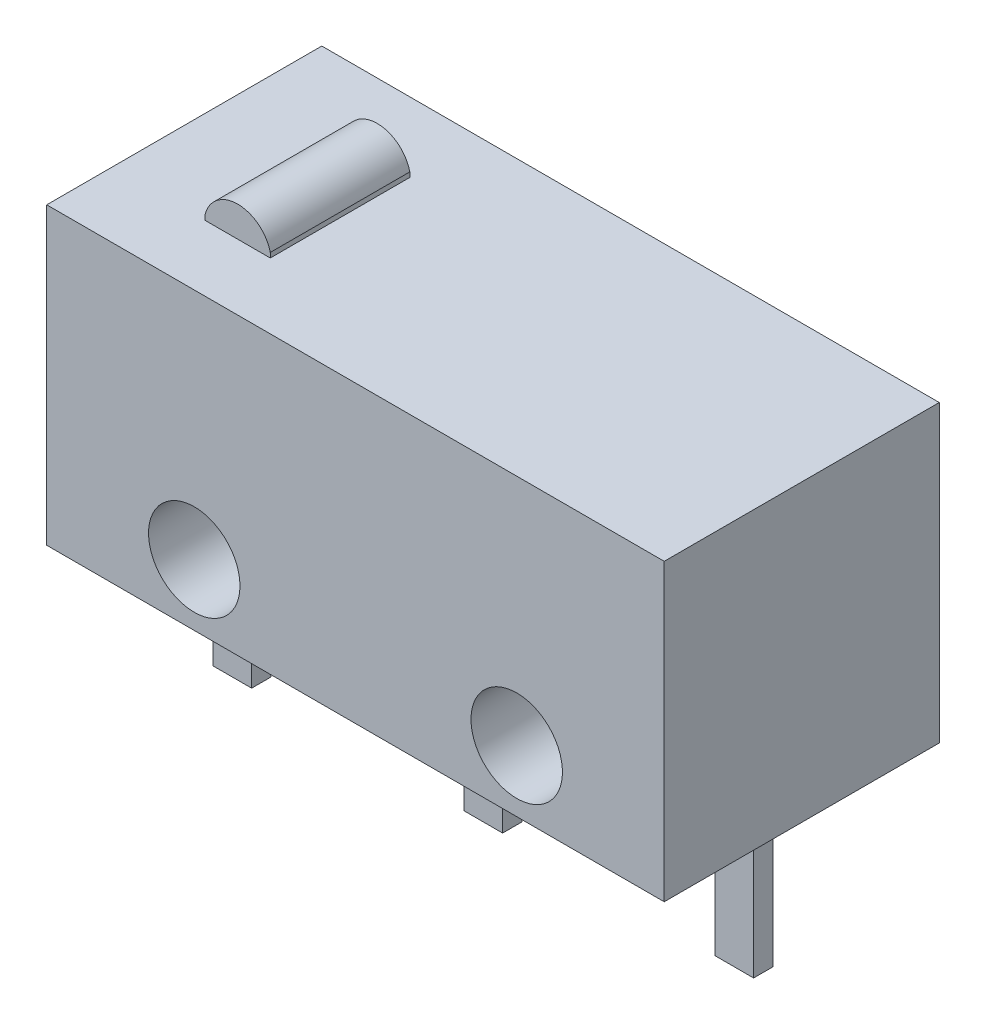
ISO-10303-21;
HEADER;
FILE_DESCRIPTION(('STEP AP214'),'2;1');
FILE_NAME('part.step','',(''),(''),'','','');
FILE_SCHEMA(('AUTOMOTIVE_DESIGN { 1 0 10303 214 1 1 1 1 }'));
ENDSEC;
DATA;
#1=APPLICATION_CONTEXT('core data for automotive mechanical design processes');
#2=APPLICATION_PROTOCOL_DEFINITION('international standard','automotive_design',2000,#1);
#3=PRODUCT_CONTEXT('',#1,'mechanical');
#4=PRODUCT('Part','Part','',(#3));
#5=PRODUCT_RELATED_PRODUCT_CATEGORY('part','',(#4));
#6=PRODUCT_DEFINITION_FORMATION('','',#4);
#7=PRODUCT_DEFINITION_CONTEXT('part definition',#1,'design');
#8=PRODUCT_DEFINITION('design','',#6,#7);
#9=PRODUCT_DEFINITION_SHAPE('','',#8);
#10=(LENGTH_UNIT() NAMED_UNIT(*) SI_UNIT(.MILLI.,.METRE.));
#11=(NAMED_UNIT(*) PLANE_ANGLE_UNIT() SI_UNIT($,.RADIAN.));
#12=(NAMED_UNIT(*) SI_UNIT($,.STERADIAN.) SOLID_ANGLE_UNIT());
#13=UNCERTAINTY_MEASURE_WITH_UNIT(LENGTH_MEASURE(1.E-05),#10,'distance_accuracy_value','');
#14=(GEOMETRIC_REPRESENTATION_CONTEXT(3) GLOBAL_UNCERTAINTY_ASSIGNED_CONTEXT((#13)) GLOBAL_UNIT_ASSIGNED_CONTEXT((#10,
#11,#12)) REPRESENTATION_CONTEXT('',''));
#15=CARTESIAN_POINT('',(0.,0.,0.));
#16=DIRECTION('',(0.,0.,1.));
#17=DIRECTION('',(1.,0.,0.));
#18=AXIS2_PLACEMENT_3D('',#15,#16,#17);
#19=CARTESIAN_POINT('',(-9.68,-1.5,2.815));
#20=DIRECTION('',(0.,-1.,0.));
#21=DIRECTION('',(0.,0.,-1.));
#22=AXIS2_PLACEMENT_3D('',#19,#20,#21);
#23=PLANE('',#22);
#24=DIRECTION('',(0.,0.,-1.));
#25=VECTOR('',#24,1.);
#26=CARTESIAN_POINT('',(-3.665,-1.5,-0.2425));
#27=LINE('',#26,#25);
#28=CARTESIAN_POINT('',(-3.665,-1.5,0.157500000000001));
#29=VERTEX_POINT('',#28);
#30=CARTESIAN_POINT('',(-3.665,-1.5,-0.2425));
#31=VERTEX_POINT('',#30);
#32=EDGE_CURVE('E253',#29,#31,#27,.T.);
#33=ORIENTED_EDGE('',*,*,#32,.F.);
#34=DIRECTION('',(-1.,0.,0.));
#35=VECTOR('',#34,1.);
#36=CARTESIAN_POINT('',(-3.665,-1.5,0.157500000000001));
#37=LINE('',#36,#35);
#38=CARTESIAN_POINT('',(-2.865,-1.5,0.157500000000001));
#39=VERTEX_POINT('',#38);
#40=EDGE_CURVE('E239',#39,#29,#37,.T.);
#41=ORIENTED_EDGE('',*,*,#40,.F.);
#42=DIRECTION('',(0.,0.,1.));
#43=VECTOR('',#42,1.);
#44=CARTESIAN_POINT('',(-2.865,-1.5,0.157500000000001));
#45=LINE('',#44,#43);
#46=CARTESIAN_POINT('',(-2.865,-1.5,-0.2425));
#47=VERTEX_POINT('',#46);
#48=EDGE_CURVE('E244',#47,#39,#45,.T.);
#49=ORIENTED_EDGE('',*,*,#48,.F.);
#50=DIRECTION('',(1.,0.,0.));
#51=VECTOR('',#50,1.);
#52=CARTESIAN_POINT('',(-2.865,-1.5,-0.2425));
#53=LINE('',#52,#51);
#54=EDGE_CURVE('E255',#31,#47,#53,.T.);
#55=ORIENTED_EDGE('',*,*,#54,.F.);
#56=EDGE_LOOP('',(#33,#41,#49,#55));
#57=FACE_BOUND('',#56,.T.);
#58=DIRECTION('',(0.,0.,-1.));
#59=VECTOR('',#58,1.);
#60=CARTESIAN_POINT('',(3.15,-1.5,2.815));
#61=LINE('',#60,#59);
#62=CARTESIAN_POINT('',(3.15,-1.5,2.815));
#63=VERTEX_POINT('',#62);
#64=CARTESIAN_POINT('',(3.15,-1.5,-2.9));
#65=VERTEX_POINT('',#64);
#66=EDGE_CURVE('E318',#63,#65,#61,.T.);
#67=ORIENTED_EDGE('',*,*,#66,.F.);
#68=DIRECTION('',(1.,0.,0.));
#69=VECTOR('',#68,1.);
#70=CARTESIAN_POINT('',(-9.68,-1.5,2.815));
#71=LINE('',#70,#69);
#72=CARTESIAN_POINT('',(-9.68,-1.5,2.815));
#73=VERTEX_POINT('',#72);
#74=EDGE_CURVE('E11',#73,#63,#71,.T.);
#75=ORIENTED_EDGE('',*,*,#74,.F.);
#76=DIRECTION('',(0.,0.,-1.));
#77=VECTOR('',#76,1.);
#78=CARTESIAN_POINT('',(-9.68,-1.5,2.815));
#79=LINE('',#78,#77);
#80=CARTESIAN_POINT('',(-9.68,-1.5,-2.9));
#81=VERTEX_POINT('',#80);
#82=EDGE_CURVE('E304',#73,#81,#79,.T.);
#83=ORIENTED_EDGE('',*,*,#82,.T.);
#84=DIRECTION('',(1.,0.,0.));
#85=VECTOR('',#84,1.);
#86=CARTESIAN_POINT('',(-9.68,-1.5,-2.9));
#87=LINE('',#86,#85);
#88=EDGE_CURVE('E317',#81,#65,#87,.T.);
#89=ORIENTED_EDGE('',*,*,#88,.T.);
#90=EDGE_LOOP('',(#67,#75,#83,#89));
#91=FACE_BOUND('',#90,.T.);
#92=DIRECTION('',(0.,0.,-1.));
#93=VECTOR('',#92,1.);
#94=CARTESIAN_POINT('',(-8.88,-1.5,-0.2425));
#95=LINE('',#94,#93);
#96=CARTESIAN_POINT('',(-8.88,-1.5,0.1575));
#97=VERTEX_POINT('',#96);
#98=CARTESIAN_POINT('',(-8.88,-1.5,-0.2425));
#99=VERTEX_POINT('',#98);
#100=EDGE_CURVE('E282',#97,#99,#95,.T.);
#101=ORIENTED_EDGE('',*,*,#100,.F.);
#102=DIRECTION('',(-1.,0.,0.));
#103=VECTOR('',#102,1.);
#104=CARTESIAN_POINT('',(-8.88,-1.5,0.1575));
#105=LINE('',#104,#103);
#106=CARTESIAN_POINT('',(-8.08,-1.5,0.1575));
#107=VERTEX_POINT('',#106);
#108=EDGE_CURVE('E268',#107,#97,#105,.T.);
#109=ORIENTED_EDGE('',*,*,#108,.F.);
#110=DIRECTION('',(0.,0.,1.));
#111=VECTOR('',#110,1.);
#112=CARTESIAN_POINT('',(-8.08,-1.5,0.1575));
#113=LINE('',#112,#111);
#114=CARTESIAN_POINT('',(-8.08,-1.5,-0.2425));
#115=VERTEX_POINT('',#114);
#116=EDGE_CURVE('E273',#115,#107,#113,.T.);
#117=ORIENTED_EDGE('',*,*,#116,.F.);
#118=DIRECTION('',(1.,0.,0.));
#119=VECTOR('',#118,1.);
#120=CARTESIAN_POINT('',(-8.08,-1.5,-0.2425));
#121=LINE('',#120,#119);
#122=EDGE_CURVE('E284',#99,#115,#121,.T.);
#123=ORIENTED_EDGE('',*,*,#122,.F.);
#124=EDGE_LOOP('',(#101,#109,#117,#123));
#125=FACE_BOUND('',#124,.T.);
#126=DIRECTION('',(-1.,0.,0.));
#127=VECTOR('',#126,1.);
#128=CARTESIAN_POINT('',(2.35,-1.5,0.1575));
#129=LINE('',#128,#127);
#130=CARTESIAN_POINT('',(2.35,-1.5,0.1575));
#131=VERTEX_POINT('',#130);
#132=CARTESIAN_POINT('',(1.55,-1.5,0.1575));
#133=VERTEX_POINT('',#132);
#134=EDGE_CURVE('E226',#131,#133,#129,.T.);
#135=ORIENTED_EDGE('',*,*,#134,.F.);
#136=DIRECTION('',(0.,0.,1.));
#137=VECTOR('',#136,1.);
#138=CARTESIAN_POINT('',(2.35,-1.5,-0.2425));
#139=LINE('',#138,#137);
#140=CARTESIAN_POINT('',(2.35,-1.5,-0.2425));
#141=VERTEX_POINT('',#140);
#142=EDGE_CURVE('E209',#141,#131,#139,.T.);
#143=ORIENTED_EDGE('',*,*,#142,.F.);
#144=DIRECTION('',(1.,0.,0.));
#145=VECTOR('',#144,1.);
#146=CARTESIAN_POINT('',(1.55,-1.5,-0.2425));
#147=LINE('',#146,#145);
#148=CARTESIAN_POINT('',(1.55,-1.5,-0.2425));
#149=VERTEX_POINT('',#148);
#150=EDGE_CURVE('E217',#149,#141,#147,.T.);
#151=ORIENTED_EDGE('',*,*,#150,.F.);
#152=DIRECTION('',(0.,0.,-1.));
#153=VECTOR('',#152,1.);
#154=CARTESIAN_POINT('',(1.55,-1.5,0.1575));
#155=LINE('',#154,#153);
#156=EDGE_CURVE('E228',#133,#149,#155,.T.);
#157=ORIENTED_EDGE('',*,*,#156,.F.);
#158=EDGE_LOOP('',(#135,#143,#151,#157));
#159=FACE_BOUND('',#158,.T.);
#160=ADVANCED_FACE('F35',(#57,#91,#125,#159),#23,.T.);
#161=CARTESIAN_POINT('',(-9.68,4.627,2.815));
#162=DIRECTION('',(0.,0.,1.));
#163=DIRECTION('',(1.,0.,0.));
#164=AXIS2_PLACEMENT_3D('',#161,#162,#163);
#165=PLANE('',#164);
#166=CARTESIAN_POINT('',(0.085,-0.222999999999999,2.815));
#167=DIRECTION('',(0.,0.,1.));
#168=DIRECTION('',(-1.,0.,0.));
#169=AXIS2_PLACEMENT_3D('',#166,#167,#168);
#170=CIRCLE('',#169,0.95);
#171=CARTESIAN_POINT('',(-0.865,-0.222999999999999,2.815));
#172=VERTEX_POINT('',#171);
#173=EDGE_CURVE('E297',#172,#172,#170,.T.);
#174=ORIENTED_EDGE('',*,*,#173,.F.);
#175=EDGE_LOOP('',(#174));
#176=FACE_BOUND('',#175,.T.);
#177=CARTESIAN_POINT('',(-6.615,-0.222999999999999,2.815));
#178=DIRECTION('',(0.,0.,1.));
#179=DIRECTION('',(1.,0.,0.));
#180=AXIS2_PLACEMENT_3D('',#177,#178,#179);
#181=CIRCLE('',#180,0.95);
#182=CARTESIAN_POINT('',(-5.665,-0.222999999999999,2.815));
#183=VERTEX_POINT('',#182);
#184=EDGE_CURVE('E300',#183,#183,#181,.T.);
#185=ORIENTED_EDGE('',*,*,#184,.F.);
#186=EDGE_LOOP('',(#185));
#187=FACE_BOUND('',#186,.T.);
#188=DIRECTION('',(0.,-1.,0.));
#189=VECTOR('',#188,1.);
#190=CARTESIAN_POINT('',(3.15,4.627,2.815));
#191=LINE('',#190,#189);
#192=CARTESIAN_POINT('',(3.15,4.627,2.815));
#193=VERTEX_POINT('',#192);
#194=EDGE_CURVE('E308',#193,#63,#191,.T.);
#195=ORIENTED_EDGE('',*,*,#194,.F.);
#196=DIRECTION('',(1.,0.,0.));
#197=VECTOR('',#196,1.);
#198=CARTESIAN_POINT('',(-9.68,4.627,2.815));
#199=LINE('',#198,#197);
#200=CARTESIAN_POINT('',(-9.68,4.627,2.815));
#201=VERTEX_POINT('',#200);
#202=EDGE_CURVE('E43',#201,#193,#199,.T.);
#203=ORIENTED_EDGE('',*,*,#202,.F.);
#204=DIRECTION('',(0.,-1.,0.));
#205=VECTOR('',#204,1.);
#206=CARTESIAN_POINT('',(-9.68,4.627,2.815));
#207=LINE('',#206,#205);
#208=EDGE_CURVE('E314',#201,#73,#207,.T.);
#209=ORIENTED_EDGE('',*,*,#208,.T.);
#210=ORIENTED_EDGE('',*,*,#74,.T.);
#211=EDGE_LOOP('',(#195,#203,#209,#210));
#212=FACE_BOUND('',#211,.T.);
#213=ADVANCED_FACE('F358',(#176,#187,#212),#165,.T.);
#214=CARTESIAN_POINT('',(-9.68,4.627,-2.9));
#215=DIRECTION('',(0.,1.,0.));
#216=DIRECTION('',(0.,0.,1.));
#217=AXIS2_PLACEMENT_3D('',#214,#215,#216);
#218=PLANE('',#217);
#219=DIRECTION('',(-1.,0.,0.));
#220=VECTOR('',#219,1.);
#221=CARTESIAN_POINT('',(-7.75567903627533,4.627,1.45));
#222=LINE('',#221,#220);
#223=CARTESIAN_POINT('',(-6.40017995171817,4.627,1.45));
#224=VERTEX_POINT('',#223);
#225=CARTESIAN_POINT('',(-7.75567903627533,4.627,1.45));
#226=VERTEX_POINT('',#225);
#227=EDGE_CURVE('E184',#224,#226,#222,.T.);
#228=ORIENTED_EDGE('',*,*,#227,.T.);
#229=DIRECTION('',(0.,0.,-1.));
#230=VECTOR('',#229,1.);
#231=CARTESIAN_POINT('',(-7.75567903627533,4.627,1.45));
#232=LINE('',#231,#230);
#233=CARTESIAN_POINT('',(-7.75567903627533,4.627,-1.45));
#234=VERTEX_POINT('',#233);
#235=EDGE_CURVE('E197',#226,#234,#232,.T.);
#236=ORIENTED_EDGE('',*,*,#235,.T.);
#237=DIRECTION('',(-1.,0.,0.));
#238=VECTOR('',#237,1.);
#239=CARTESIAN_POINT('',(-7.75567903627533,4.627,-1.45));
#240=LINE('',#239,#238);
#241=CARTESIAN_POINT('',(-6.40017995171817,4.627,-1.45));
#242=VERTEX_POINT('',#241);
#243=EDGE_CURVE('E198',#242,#234,#240,.T.);
#244=ORIENTED_EDGE('',*,*,#243,.F.);
#245=DIRECTION('',(0.,0.,-1.));
#246=VECTOR('',#245,1.);
#247=CARTESIAN_POINT('',(-6.40017995171817,4.627,1.45));
#248=LINE('',#247,#246);
#249=EDGE_CURVE('E210',#224,#242,#248,.T.);
#250=ORIENTED_EDGE('',*,*,#249,.F.);
#251=EDGE_LOOP('',(#228,#236,#244,#250));
#252=FACE_BOUND('',#251,.T.);
#253=DIRECTION('',(0.,0.,1.));
#254=VECTOR('',#253,1.);
#255=CARTESIAN_POINT('',(3.15,4.627,-2.9));
#256=LINE('',#255,#254);
#257=CARTESIAN_POINT('',(3.15,4.627,-2.9));
#258=VERTEX_POINT('',#257);
#259=EDGE_CURVE('E324',#258,#193,#256,.T.);
#260=ORIENTED_EDGE('',*,*,#259,.F.);
#261=DIRECTION('',(1.,0.,0.));
#262=VECTOR('',#261,1.);
#263=CARTESIAN_POINT('',(-9.68,4.627,-2.9));
#264=LINE('',#263,#262);
#265=CARTESIAN_POINT('',(-9.68,4.627,-2.9));
#266=VERTEX_POINT('',#265);
#267=EDGE_CURVE('E330',#266,#258,#264,.T.);
#268=ORIENTED_EDGE('',*,*,#267,.F.);
#269=DIRECTION('',(0.,0.,1.));
#270=VECTOR('',#269,1.);
#271=CARTESIAN_POINT('',(-9.68,4.627,-2.9));
#272=LINE('',#271,#270);
#273=EDGE_CURVE('E311',#266,#201,#272,.T.);
#274=ORIENTED_EDGE('',*,*,#273,.T.);
#275=ORIENTED_EDGE('',*,*,#202,.T.);
#276=EDGE_LOOP('',(#260,#268,#274,#275));
#277=FACE_BOUND('',#276,.T.);
#278=ADVANCED_FACE('F342',(#252,#277),#218,.T.);
#279=CARTESIAN_POINT('',(-9.68,-1.5,-2.9));
#280=DIRECTION('',(0.,0.,-1.));
#281=DIRECTION('',(-1.,0.,0.));
#282=AXIS2_PLACEMENT_3D('',#279,#280,#281);
#283=PLANE('',#282);
#284=CARTESIAN_POINT('',(0.085,-0.222999999999999,-2.9));
#285=DIRECTION('',(0.,0.,-1.));
#286=DIRECTION('',(-1.,0.,0.));
#287=AXIS2_PLACEMENT_3D('',#284,#285,#286);
#288=CIRCLE('',#287,0.95);
#289=CARTESIAN_POINT('',(-0.865,-0.222999999999999,-2.9));
#290=VERTEX_POINT('',#289);
#291=EDGE_CURVE('E38',#290,#290,#288,.T.);
#292=ORIENTED_EDGE('',*,*,#291,.F.);
#293=EDGE_LOOP('',(#292));
#294=FACE_BOUND('',#293,.T.);
#295=CARTESIAN_POINT('',(-6.615,-0.222999999999999,-2.9));
#296=DIRECTION('',(0.,0.,-1.));
#297=DIRECTION('',(-1.,0.,0.));
#298=AXIS2_PLACEMENT_3D('',#295,#296,#297);
#299=CIRCLE('',#298,0.95);
#300=CARTESIAN_POINT('',(-7.565,-0.222999999999999,-2.9));
#301=VERTEX_POINT('',#300);
#302=EDGE_CURVE('E303',#301,#301,#299,.T.);
#303=ORIENTED_EDGE('',*,*,#302,.F.);
#304=EDGE_LOOP('',(#303));
#305=FACE_BOUND('',#304,.T.);
#306=DIRECTION('',(0.,1.,0.));
#307=VECTOR('',#306,1.);
#308=CARTESIAN_POINT('',(3.15,-1.5,-2.9));
#309=LINE('',#308,#307);
#310=EDGE_CURVE('E321',#65,#258,#309,.T.);
#311=ORIENTED_EDGE('',*,*,#310,.F.);
#312=ORIENTED_EDGE('',*,*,#88,.F.);
#313=DIRECTION('',(0.,1.,0.));
#314=VECTOR('',#313,1.);
#315=CARTESIAN_POINT('',(-9.68,-1.5,-2.9));
#316=LINE('',#315,#314);
#317=EDGE_CURVE('E307',#81,#266,#316,.T.);
#318=ORIENTED_EDGE('',*,*,#317,.T.);
#319=ORIENTED_EDGE('',*,*,#267,.T.);
#320=EDGE_LOOP('',(#311,#312,#318,#319));
#321=FACE_BOUND('',#320,.T.);
#322=ADVANCED_FACE('F338',(#294,#305,#321),#283,.T.);
#323=CARTESIAN_POINT('',(-9.68,-1.5,-2.9));
#324=DIRECTION('',(1.,0.,0.));
#325=DIRECTION('',(0.,0.,-1.));
#326=AXIS2_PLACEMENT_3D('',#323,#324,#325);
#327=PLANE('',#326);
#328=ORIENTED_EDGE('',*,*,#82,.F.);
#329=ORIENTED_EDGE('',*,*,#208,.F.);
#330=ORIENTED_EDGE('',*,*,#273,.F.);
#331=ORIENTED_EDGE('',*,*,#317,.F.);
#332=EDGE_LOOP('',(#328,#329,#330,#331));
#333=FACE_BOUND('',#332,.T.);
#334=ADVANCED_FACE('F341',(#333),#327,.F.);
#335=CARTESIAN_POINT('',(3.15,-1.5,-2.9));
#336=DIRECTION('',(1.,0.,0.));
#337=DIRECTION('',(0.,0.,-1.));
#338=AXIS2_PLACEMENT_3D('',#335,#336,#337);
#339=PLANE('',#338);
#340=ORIENTED_EDGE('',*,*,#66,.T.);
#341=ORIENTED_EDGE('',*,*,#310,.T.);
#342=ORIENTED_EDGE('',*,*,#259,.T.);
#343=ORIENTED_EDGE('',*,*,#194,.T.);
#344=EDGE_LOOP('',(#340,#341,#342,#343));
#345=FACE_BOUND('',#344,.T.);
#346=ADVANCED_FACE('F349',(#345),#339,.T.);
#347=CARTESIAN_POINT('',(-6.615,-0.222999999999999,-17.985));
#348=DIRECTION('',(0.,0.,1.));
#349=DIRECTION('',(1.,0.,0.));
#350=AXIS2_PLACEMENT_3D('',#347,#348,#349);
#351=CYLINDRICAL_SURFACE('',#350,0.95);
#352=ORIENTED_EDGE('',*,*,#302,.T.);
#353=EDGE_LOOP('',(#352));
#354=FACE_BOUND('',#353,.T.);
#355=ORIENTED_EDGE('',*,*,#184,.T.);
#356=EDGE_LOOP('',(#355));
#357=FACE_BOUND('',#356,.T.);
#358=ADVANCED_FACE('F335',(#354,#357),#351,.F.);
#359=CARTESIAN_POINT('',(0.085,-0.222999999999999,-17.985));
#360=DIRECTION('',(0.,0.,1.));
#361=DIRECTION('',(1.,0.,0.));
#362=AXIS2_PLACEMENT_3D('',#359,#360,#361);
#363=CYLINDRICAL_SURFACE('',#362,0.95);
#364=ORIENTED_EDGE('',*,*,#291,.T.);
#365=EDGE_LOOP('',(#364));
#366=FACE_BOUND('',#365,.T.);
#367=ORIENTED_EDGE('',*,*,#173,.T.);
#368=EDGE_LOOP('',(#367));
#369=FACE_BOUND('',#368,.T.);
#370=ADVANCED_FACE('F427',(#366,#369),#363,.F.);
#371=CARTESIAN_POINT('',(-8.88,-4.6,0.1575));
#372=DIRECTION('',(0.,0.,-1.));
#373=DIRECTION('',(-1.,0.,0.));
#374=AXIS2_PLACEMENT_3D('',#371,#372,#373);
#375=PLANE('',#374);
#376=ORIENTED_EDGE('',*,*,#108,.T.);
#377=DIRECTION('',(0.,1.,0.));
#378=VECTOR('',#377,1.);
#379=CARTESIAN_POINT('',(-8.88,-4.6,0.1575));
#380=LINE('',#379,#378);
#381=CARTESIAN_POINT('',(-8.88,-4.6,0.1575));
#382=VERTEX_POINT('',#381);
#383=EDGE_CURVE('E295',#382,#97,#380,.T.);
#384=ORIENTED_EDGE('',*,*,#383,.F.);
#385=DIRECTION('',(-1.,0.,0.));
#386=VECTOR('',#385,1.);
#387=CARTESIAN_POINT('',(-8.88,-4.6,0.1575));
#388=LINE('',#387,#386);
#389=CARTESIAN_POINT('',(-8.08,-4.6,0.1575));
#390=VERTEX_POINT('',#389);
#391=EDGE_CURVE('E269',#390,#382,#388,.T.);
#392=ORIENTED_EDGE('',*,*,#391,.F.);
#393=DIRECTION('',(0.,1.,0.));
#394=VECTOR('',#393,1.);
#395=CARTESIAN_POINT('',(-8.08,-4.6,0.1575));
#396=LINE('',#395,#394);
#397=EDGE_CURVE('E279',#390,#107,#396,.T.);
#398=ORIENTED_EDGE('',*,*,#397,.T.);
#399=EDGE_LOOP('',(#376,#384,#392,#398));
#400=FACE_BOUND('',#399,.T.);
#401=ADVANCED_FACE('F423',(#400),#375,.F.);
#402=CARTESIAN_POINT('',(-8.88,-4.6,-0.2425));
#403=DIRECTION('',(1.,0.,0.));
#404=DIRECTION('',(0.,0.,-1.));
#405=AXIS2_PLACEMENT_3D('',#402,#403,#404);
#406=PLANE('',#405);
#407=ORIENTED_EDGE('',*,*,#100,.T.);
#408=DIRECTION('',(0.,1.,0.));
#409=VECTOR('',#408,1.);
#410=CARTESIAN_POINT('',(-8.88,-4.6,-0.2425));
#411=LINE('',#410,#409);
#412=CARTESIAN_POINT('',(-8.88,-4.6,-0.2425));
#413=VERTEX_POINT('',#412);
#414=EDGE_CURVE('E292',#413,#99,#411,.T.);
#415=ORIENTED_EDGE('',*,*,#414,.F.);
#416=DIRECTION('',(0.,0.,-1.));
#417=VECTOR('',#416,1.);
#418=CARTESIAN_POINT('',(-8.88,-4.6,-0.2425));
#419=LINE('',#418,#417);
#420=EDGE_CURVE('E272',#382,#413,#419,.T.);
#421=ORIENTED_EDGE('',*,*,#420,.F.);
#422=ORIENTED_EDGE('',*,*,#383,.T.);
#423=EDGE_LOOP('',(#407,#415,#421,#422));
#424=FACE_BOUND('',#423,.T.);
#425=ADVANCED_FACE('F419',(#424),#406,.F.);
#426=CARTESIAN_POINT('',(-8.08,-4.6,-0.2425));
#427=DIRECTION('',(0.,0.,1.));
#428=DIRECTION('',(1.,0.,0.));
#429=AXIS2_PLACEMENT_3D('',#426,#427,#428);
#430=PLANE('',#429);
#431=ORIENTED_EDGE('',*,*,#122,.T.);
#432=DIRECTION('',(0.,1.,0.));
#433=VECTOR('',#432,1.);
#434=CARTESIAN_POINT('',(-8.08,-4.6,-0.2425));
#435=LINE('',#434,#433);
#436=CARTESIAN_POINT('',(-8.08,-4.6,-0.2425));
#437=VERTEX_POINT('',#436);
#438=EDGE_CURVE('E290',#437,#115,#435,.T.);
#439=ORIENTED_EDGE('',*,*,#438,.F.);
#440=DIRECTION('',(1.,0.,0.));
#441=VECTOR('',#440,1.);
#442=CARTESIAN_POINT('',(-8.08,-4.6,-0.2425));
#443=LINE('',#442,#441);
#444=EDGE_CURVE('E275',#413,#437,#443,.T.);
#445=ORIENTED_EDGE('',*,*,#444,.F.);
#446=ORIENTED_EDGE('',*,*,#414,.T.);
#447=EDGE_LOOP('',(#431,#439,#445,#446));
#448=FACE_BOUND('',#447,.T.);
#449=ADVANCED_FACE('F415',(#448),#430,.F.);
#450=CARTESIAN_POINT('',(-8.08,-4.6,0.1575));
#451=DIRECTION('',(-1.,0.,0.));
#452=DIRECTION('',(0.,0.,1.));
#453=AXIS2_PLACEMENT_3D('',#450,#451,#452);
#454=PLANE('',#453);
#455=ORIENTED_EDGE('',*,*,#116,.T.);
#456=ORIENTED_EDGE('',*,*,#397,.F.);
#457=DIRECTION('',(0.,0.,1.));
#458=VECTOR('',#457,1.);
#459=CARTESIAN_POINT('',(-8.08,-4.6,0.1575));
#460=LINE('',#459,#458);
#461=EDGE_CURVE('E277',#437,#390,#460,.T.);
#462=ORIENTED_EDGE('',*,*,#461,.F.);
#463=ORIENTED_EDGE('',*,*,#438,.T.);
#464=EDGE_LOOP('',(#455,#456,#462,#463));
#465=FACE_BOUND('',#464,.T.);
#466=ADVANCED_FACE('F411',(#465),#454,.F.);
#467=CARTESIAN_POINT('',(-8.08,-4.6,0.1575));
#468=DIRECTION('',(0.,1.,0.));
#469=DIRECTION('',(0.,0.,1.));
#470=AXIS2_PLACEMENT_3D('',#467,#468,#469);
#471=PLANE('',#470);
#472=ORIENTED_EDGE('',*,*,#391,.T.);
#473=ORIENTED_EDGE('',*,*,#420,.T.);
#474=ORIENTED_EDGE('',*,*,#444,.T.);
#475=ORIENTED_EDGE('',*,*,#461,.T.);
#476=EDGE_LOOP('',(#472,#473,#474,#475));
#477=FACE_BOUND('',#476,.T.);
#478=ADVANCED_FACE('F408',(#477),#471,.F.);
#479=CARTESIAN_POINT('',(-3.665,-4.6,0.157500000000001));
#480=DIRECTION('',(0.,0.,-1.));
#481=DIRECTION('',(-1.,0.,0.));
#482=AXIS2_PLACEMENT_3D('',#479,#480,#481);
#483=PLANE('',#482);
#484=ORIENTED_EDGE('',*,*,#40,.T.);
#485=DIRECTION('',(0.,1.,0.));
#486=VECTOR('',#485,1.);
#487=CARTESIAN_POINT('',(-3.665,-4.6,0.157500000000001));
#488=LINE('',#487,#486);
#489=CARTESIAN_POINT('',(-3.665,-4.6,0.157500000000001));
#490=VERTEX_POINT('',#489);
#491=EDGE_CURVE('E266',#490,#29,#488,.T.);
#492=ORIENTED_EDGE('',*,*,#491,.F.);
#493=DIRECTION('',(-1.,0.,0.));
#494=VECTOR('',#493,1.);
#495=CARTESIAN_POINT('',(-3.665,-4.6,0.157500000000001));
#496=LINE('',#495,#494);
#497=CARTESIAN_POINT('',(-2.865,-4.6,0.157500000000001));
#498=VERTEX_POINT('',#497);
#499=EDGE_CURVE('E240',#498,#490,#496,.T.);
#500=ORIENTED_EDGE('',*,*,#499,.F.);
#501=DIRECTION('',(0.,1.,0.));
#502=VECTOR('',#501,1.);
#503=CARTESIAN_POINT('',(-2.865,-4.6,0.157500000000001));
#504=LINE('',#503,#502);
#505=EDGE_CURVE('E250',#498,#39,#504,.T.);
#506=ORIENTED_EDGE('',*,*,#505,.T.);
#507=EDGE_LOOP('',(#484,#492,#500,#506));
#508=FACE_BOUND('',#507,.T.);
#509=ADVANCED_FACE('F390',(#508),#483,.F.);
#510=CARTESIAN_POINT('',(-3.665,-4.6,-0.2425));
#511=DIRECTION('',(1.,0.,0.));
#512=DIRECTION('',(0.,0.,-1.));
#513=AXIS2_PLACEMENT_3D('',#510,#511,#512);
#514=PLANE('',#513);
#515=ORIENTED_EDGE('',*,*,#32,.T.);
#516=DIRECTION('',(0.,1.,0.));
#517=VECTOR('',#516,1.);
#518=CARTESIAN_POINT('',(-3.665,-4.6,-0.2425));
#519=LINE('',#518,#517);
#520=CARTESIAN_POINT('',(-3.665,-4.6,-0.2425));
#521=VERTEX_POINT('',#520);
#522=EDGE_CURVE('E263',#521,#31,#519,.T.);
#523=ORIENTED_EDGE('',*,*,#522,.F.);
#524=DIRECTION('',(0.,0.,-1.));
#525=VECTOR('',#524,1.);
#526=CARTESIAN_POINT('',(-3.665,-4.6,-0.2425));
#527=LINE('',#526,#525);
#528=EDGE_CURVE('E243',#490,#521,#527,.T.);
#529=ORIENTED_EDGE('',*,*,#528,.F.);
#530=ORIENTED_EDGE('',*,*,#491,.T.);
#531=EDGE_LOOP('',(#515,#523,#529,#530));
#532=FACE_BOUND('',#531,.T.);
#533=ADVANCED_FACE('F378',(#532),#514,.F.);
#534=CARTESIAN_POINT('',(-2.865,-4.6,-0.2425));
#535=DIRECTION('',(0.,0.,1.));
#536=DIRECTION('',(1.,0.,0.));
#537=AXIS2_PLACEMENT_3D('',#534,#535,#536);
#538=PLANE('',#537);
#539=ORIENTED_EDGE('',*,*,#54,.T.);
#540=DIRECTION('',(0.,1.,0.));
#541=VECTOR('',#540,1.);
#542=CARTESIAN_POINT('',(-2.865,-4.6,-0.2425));
#543=LINE('',#542,#541);
#544=CARTESIAN_POINT('',(-2.865,-4.6,-0.2425));
#545=VERTEX_POINT('',#544);
#546=EDGE_CURVE('E261',#545,#47,#543,.T.);
#547=ORIENTED_EDGE('',*,*,#546,.F.);
#548=DIRECTION('',(1.,0.,0.));
#549=VECTOR('',#548,1.);
#550=CARTESIAN_POINT('',(-2.865,-4.6,-0.2425));
#551=LINE('',#550,#549);
#552=EDGE_CURVE('E246',#521,#545,#551,.T.);
#553=ORIENTED_EDGE('',*,*,#552,.F.);
#554=ORIENTED_EDGE('',*,*,#522,.T.);
#555=EDGE_LOOP('',(#539,#547,#553,#554));
#556=FACE_BOUND('',#555,.T.);
#557=ADVANCED_FACE('F382',(#556),#538,.F.);
#558=CARTESIAN_POINT('',(-2.865,-4.6,0.157500000000001));
#559=DIRECTION('',(-1.,0.,0.));
#560=DIRECTION('',(0.,0.,1.));
#561=AXIS2_PLACEMENT_3D('',#558,#559,#560);
#562=PLANE('',#561);
#563=ORIENTED_EDGE('',*,*,#48,.T.);
#564=ORIENTED_EDGE('',*,*,#505,.F.);
#565=DIRECTION('',(0.,0.,1.));
#566=VECTOR('',#565,1.);
#567=CARTESIAN_POINT('',(-2.865,-4.6,0.157500000000001));
#568=LINE('',#567,#566);
#569=EDGE_CURVE('E248',#545,#498,#568,.T.);
#570=ORIENTED_EDGE('',*,*,#569,.F.);
#571=ORIENTED_EDGE('',*,*,#546,.T.);
#572=EDGE_LOOP('',(#563,#564,#570,#571));
#573=FACE_BOUND('',#572,.T.);
#574=ADVANCED_FACE('F392',(#573),#562,.F.);
#575=CARTESIAN_POINT('',(-2.865,-4.6,0.157500000000001));
#576=DIRECTION('',(0.,1.,0.));
#577=DIRECTION('',(0.,0.,1.));
#578=AXIS2_PLACEMENT_3D('',#575,#576,#577);
#579=PLANE('',#578);
#580=ORIENTED_EDGE('',*,*,#499,.T.);
#581=ORIENTED_EDGE('',*,*,#528,.T.);
#582=ORIENTED_EDGE('',*,*,#552,.T.);
#583=ORIENTED_EDGE('',*,*,#569,.T.);
#584=EDGE_LOOP('',(#580,#581,#582,#583));
#585=FACE_BOUND('',#584,.T.);
#586=ADVANCED_FACE('F386',(#585),#579,.F.);
#587=CARTESIAN_POINT('',(2.35,-4.6,-0.2425));
#588=DIRECTION('',(-1.,0.,0.));
#589=DIRECTION('',(0.,0.,1.));
#590=AXIS2_PLACEMENT_3D('',#587,#588,#589);
#591=PLANE('',#590);
#592=ORIENTED_EDGE('',*,*,#142,.T.);
#593=DIRECTION('',(0.,1.,0.));
#594=VECTOR('',#593,1.);
#595=CARTESIAN_POINT('',(2.35,-4.6,0.1575));
#596=LINE('',#595,#594);
#597=CARTESIAN_POINT('',(2.35,-4.6,0.1575));
#598=VERTEX_POINT('',#597);
#599=EDGE_CURVE('E237',#598,#131,#596,.T.);
#600=ORIENTED_EDGE('',*,*,#599,.F.);
#601=DIRECTION('',(0.,0.,1.));
#602=VECTOR('',#601,1.);
#603=CARTESIAN_POINT('',(2.35,-4.6,-0.2425));
#604=LINE('',#603,#602);
#605=CARTESIAN_POINT('',(2.35,-4.6,-0.2425));
#606=VERTEX_POINT('',#605);
#607=EDGE_CURVE('E213',#606,#598,#604,.T.);
#608=ORIENTED_EDGE('',*,*,#607,.F.);
#609=DIRECTION('',(0.,1.,0.));
#610=VECTOR('',#609,1.);
#611=CARTESIAN_POINT('',(2.35,-4.6,-0.2425));
#612=LINE('',#611,#610);
#613=EDGE_CURVE('E223',#606,#141,#612,.T.);
#614=ORIENTED_EDGE('',*,*,#613,.T.);
#615=EDGE_LOOP('',(#592,#600,#608,#614));
#616=FACE_BOUND('',#615,.T.);
#617=ADVANCED_FACE('F399',(#616),#591,.F.);
#618=CARTESIAN_POINT('',(2.35,-4.6,0.1575));
#619=DIRECTION('',(0.,0.,-1.));
#620=DIRECTION('',(-1.,0.,0.));
#621=AXIS2_PLACEMENT_3D('',#618,#619,#620);
#622=PLANE('',#621);
#623=ORIENTED_EDGE('',*,*,#134,.T.);
#624=DIRECTION('',(0.,1.,0.));
#625=VECTOR('',#624,1.);
#626=CARTESIAN_POINT('',(1.55,-4.6,0.1575));
#627=LINE('',#626,#625);
#628=CARTESIAN_POINT('',(1.55,-4.6,0.1575));
#629=VERTEX_POINT('',#628);
#630=EDGE_CURVE('E234',#629,#133,#627,.T.);
#631=ORIENTED_EDGE('',*,*,#630,.F.);
#632=DIRECTION('',(-1.,0.,0.));
#633=VECTOR('',#632,1.);
#634=CARTESIAN_POINT('',(2.35,-4.6,0.1575));
#635=LINE('',#634,#633);
#636=EDGE_CURVE('E216',#598,#629,#635,.T.);
#637=ORIENTED_EDGE('',*,*,#636,.F.);
#638=ORIENTED_EDGE('',*,*,#599,.T.);
#639=EDGE_LOOP('',(#623,#631,#637,#638));
#640=FACE_BOUND('',#639,.T.);
#641=ADVANCED_FACE('F502',(#640),#622,.F.);
#642=CARTESIAN_POINT('',(1.55,-4.6,0.1575));
#643=DIRECTION('',(1.,0.,0.));
#644=DIRECTION('',(0.,0.,-1.));
#645=AXIS2_PLACEMENT_3D('',#642,#643,#644);
#646=PLANE('',#645);
#647=ORIENTED_EDGE('',*,*,#156,.T.);
#648=DIRECTION('',(0.,1.,0.));
#649=VECTOR('',#648,1.);
#650=CARTESIAN_POINT('',(1.55,-4.6,-0.2425));
#651=LINE('',#650,#649);
#652=CARTESIAN_POINT('',(1.55,-4.6,-0.2425));
#653=VERTEX_POINT('',#652);
#654=EDGE_CURVE('E59',#653,#149,#651,.T.);
#655=ORIENTED_EDGE('',*,*,#654,.F.);
#656=DIRECTION('',(0.,0.,-1.));
#657=VECTOR('',#656,1.);
#658=CARTESIAN_POINT('',(1.55,-4.6,0.1575));
#659=LINE('',#658,#657);
#660=EDGE_CURVE('E219',#629,#653,#659,.T.);
#661=ORIENTED_EDGE('',*,*,#660,.F.);
#662=ORIENTED_EDGE('',*,*,#630,.T.);
#663=EDGE_LOOP('',(#647,#655,#661,#662));
#664=FACE_BOUND('',#663,.T.);
#665=ADVANCED_FACE('F511',(#664),#646,.F.);
#666=CARTESIAN_POINT('',(1.55,-4.6,-0.2425));
#667=DIRECTION('',(0.,0.,1.));
#668=DIRECTION('',(1.,0.,0.));
#669=AXIS2_PLACEMENT_3D('',#666,#667,#668);
#670=PLANE('',#669);
#671=ORIENTED_EDGE('',*,*,#150,.T.);
#672=ORIENTED_EDGE('',*,*,#613,.F.);
#673=DIRECTION('',(1.,0.,0.));
#674=VECTOR('',#673,1.);
#675=CARTESIAN_POINT('',(1.55,-4.6,-0.2425));
#676=LINE('',#675,#674);
#677=EDGE_CURVE('E221',#653,#606,#676,.T.);
#678=ORIENTED_EDGE('',*,*,#677,.F.);
#679=ORIENTED_EDGE('',*,*,#654,.T.);
#680=EDGE_LOOP('',(#671,#672,#678,#679));
#681=FACE_BOUND('',#680,.T.);
#682=ADVANCED_FACE('F521',(#681),#670,.F.);
#683=CARTESIAN_POINT('',(2.35,-4.6,0.1575));
#684=DIRECTION('',(0.,-1.,0.));
#685=DIRECTION('',(0.,0.,-1.));
#686=AXIS2_PLACEMENT_3D('',#683,#684,#685);
#687=PLANE('',#686);
#688=ORIENTED_EDGE('',*,*,#607,.T.);
#689=ORIENTED_EDGE('',*,*,#636,.T.);
#690=ORIENTED_EDGE('',*,*,#660,.T.);
#691=ORIENTED_EDGE('',*,*,#677,.T.);
#692=EDGE_LOOP('',(#688,#689,#690,#691));
#693=FACE_BOUND('',#692,.T.);
#694=ADVANCED_FACE('F531',(#693),#687,.T.);
#695=CARTESIAN_POINT('',(-7.75567903627533,4.627,1.45));
#696=DIRECTION('',(-1.,0.,0.));
#697=DIRECTION('',(0.,0.,1.));
#698=AXIS2_PLACEMENT_3D('',#695,#696,#697);
#699=PLANE('',#698);
#700=DIRECTION('',(0.,1.,0.));
#701=VECTOR('',#700,1.);
#702=CARTESIAN_POINT('',(-7.75567903627533,4.627,-1.45));
#703=LINE('',#702,#701);
#704=CARTESIAN_POINT('',(-7.75567903627533,4.727,-1.45));
#705=VERTEX_POINT('',#704);
#706=EDGE_CURVE('E204',#234,#705,#703,.T.);
#707=ORIENTED_EDGE('',*,*,#706,.F.);
#708=ORIENTED_EDGE('',*,*,#235,.F.);
#709=DIRECTION('',(0.,1.,0.));
#710=VECTOR('',#709,1.);
#711=CARTESIAN_POINT('',(-7.75567903627533,4.627,1.45));
#712=LINE('',#711,#710);
#713=CARTESIAN_POINT('',(-7.75567903627533,4.727,1.45));
#714=VERTEX_POINT('',#713);
#715=EDGE_CURVE('E191',#226,#714,#712,.T.);
#716=ORIENTED_EDGE('',*,*,#715,.T.);
#717=DIRECTION('',(0.,0.,-1.));
#718=VECTOR('',#717,1.);
#719=CARTESIAN_POINT('',(-7.75567903627533,4.727,1.45));
#720=LINE('',#719,#718);
#721=EDGE_CURVE('E175',#714,#705,#720,.T.);
#722=ORIENTED_EDGE('',*,*,#721,.T.);
#723=EDGE_LOOP('',(#707,#708,#716,#722));
#724=FACE_BOUND('',#723,.T.);
#725=ADVANCED_FACE('F195',(#724),#699,.T.);
#726=CARTESIAN_POINT('',(-6.40017995171817,4.627,1.45));
#727=DIRECTION('',(1.,0.,0.));
#728=DIRECTION('',(0.,0.,-1.));
#729=AXIS2_PLACEMENT_3D('',#726,#727,#728);
#730=PLANE('',#729);
#731=DIRECTION('',(0.,-1.,0.));
#732=VECTOR('',#731,1.);
#733=CARTESIAN_POINT('',(-6.40017995171817,4.627,-1.45));
#734=LINE('',#733,#732);
#735=CARTESIAN_POINT('',(-6.40017995171817,4.727,-1.45));
#736=VERTEX_POINT('',#735);
#737=EDGE_CURVE('E51',#736,#242,#734,.T.);
#738=ORIENTED_EDGE('',*,*,#737,.F.);
#739=DIRECTION('',(0.,0.,-1.));
#740=VECTOR('',#739,1.);
#741=CARTESIAN_POINT('',(-6.40017995171817,4.727,1.45));
#742=LINE('',#741,#740);
#743=CARTESIAN_POINT('',(-6.40017995171817,4.727,1.45));
#744=VERTEX_POINT('',#743);
#745=EDGE_CURVE('E183',#744,#736,#742,.T.);
#746=ORIENTED_EDGE('',*,*,#745,.F.);
#747=DIRECTION('',(0.,-1.,0.));
#748=VECTOR('',#747,1.);
#749=CARTESIAN_POINT('',(-6.40017995171817,4.627,1.45));
#750=LINE('',#749,#748);
#751=EDGE_CURVE('E193',#744,#224,#750,.T.);
#752=ORIENTED_EDGE('',*,*,#751,.T.);
#753=ORIENTED_EDGE('',*,*,#249,.T.);
#754=EDGE_LOOP('',(#738,#746,#752,#753));
#755=FACE_BOUND('',#754,.T.);
#756=ADVANCED_FACE('F555',(#755),#730,.T.);
#757=CARTESIAN_POINT('',(-7.07792949399675,4.56154784202727,1.45));
#758=DIRECTION('',(0.,0.,-1.));
#759=DIRECTION('',(-1.,0.,0.));
#760=AXIS2_PLACEMENT_3D('',#757,#758,#759);
#761=CYLINDRICAL_SURFACE('',#760,0.697652390977522);
#762=CARTESIAN_POINT('',(-7.07792949399675,4.56154784202727,-1.45));
#763=DIRECTION('',(0.,0.,-1.));
#764=DIRECTION('',(1.,0.,0.));
#765=AXIS2_PLACEMENT_3D('',#762,#763,#764);
#766=CIRCLE('',#765,0.697652390977522);
#767=EDGE_CURVE('E179',#705,#736,#766,.T.);
#768=ORIENTED_EDGE('',*,*,#767,.F.);
#769=ORIENTED_EDGE('',*,*,#721,.F.);
#770=CARTESIAN_POINT('',(-7.07792949399675,4.56154784202727,1.45));
#771=DIRECTION('',(0.,0.,-1.));
#772=DIRECTION('',(1.,0.,0.));
#773=AXIS2_PLACEMENT_3D('',#770,#771,#772);
#774=CIRCLE('',#773,0.697652390977522);
#775=EDGE_CURVE('E178',#714,#744,#774,.T.);
#776=ORIENTED_EDGE('',*,*,#775,.T.);
#777=ORIENTED_EDGE('',*,*,#745,.T.);
#778=EDGE_LOOP('',(#768,#769,#776,#777));
#779=FACE_BOUND('',#778,.T.);
#780=ADVANCED_FACE('F177',(#779),#761,.T.);
#781=CARTESIAN_POINT('',(-7.07792949399675,4.56154784202727,1.45));
#782=DIRECTION('',(0.,0.,1.));
#783=DIRECTION('',(1.,0.,0.));
#784=AXIS2_PLACEMENT_3D('',#781,#782,#783);
#785=PLANE('',#784);
#786=ORIENTED_EDGE('',*,*,#715,.F.);
#787=ORIENTED_EDGE('',*,*,#227,.F.);
#788=ORIENTED_EDGE('',*,*,#751,.F.);
#789=ORIENTED_EDGE('',*,*,#775,.F.);
#790=EDGE_LOOP('',(#786,#787,#788,#789));
#791=FACE_BOUND('',#790,.T.);
#792=ADVANCED_FACE('F189',(#791),#785,.T.);
#793=CARTESIAN_POINT('',(-7.07792949399675,4.56154784202727,-1.45));
#794=DIRECTION('',(0.,0.,1.));
#795=DIRECTION('',(1.,0.,0.));
#796=AXIS2_PLACEMENT_3D('',#793,#794,#795);
#797=PLANE('',#796);
#798=ORIENTED_EDGE('',*,*,#706,.T.);
#799=ORIENTED_EDGE('',*,*,#767,.T.);
#800=ORIENTED_EDGE('',*,*,#737,.T.);
#801=ORIENTED_EDGE('',*,*,#243,.T.);
#802=EDGE_LOOP('',(#798,#799,#800,#801));
#803=FACE_BOUND('',#802,.T.);
#804=ADVANCED_FACE('F581',(#803),#797,.F.);
#805=CLOSED_SHELL('',(#160,#213,#278,#322,#334,#346,#358,#370,#401,#425,#449,#466,#478,#509,
#533,#557,#574,#586,#617,#641,#665,#682,#694,#725,#756,#780,#792,#804));
#806=MANIFOLD_SOLID_BREP('B2',#805);
#807=ADVANCED_BREP_SHAPE_REPRESENTATION('',(#18,#806),#14);
#808=SHAPE_DEFINITION_REPRESENTATION(#9,#807);
ENDSEC;
END-ISO-10303-21;
